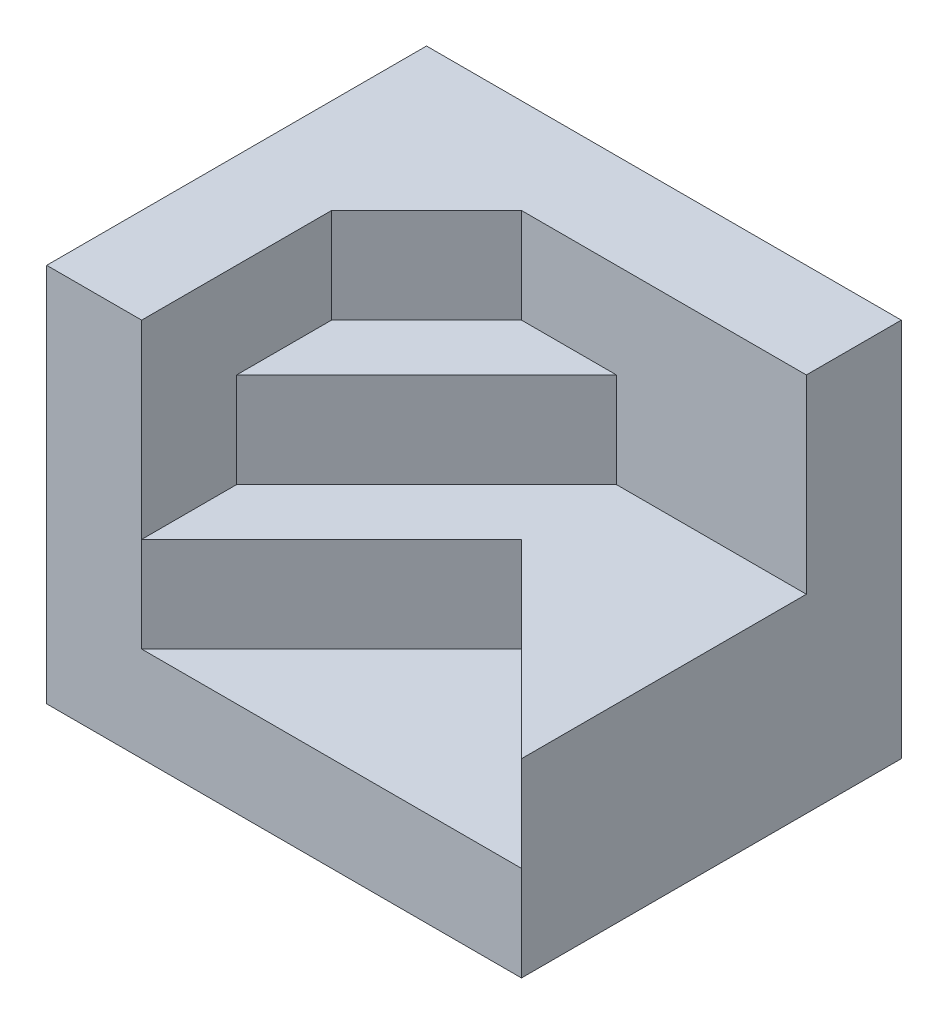
ISO-10303-21;
HEADER;
FILE_DESCRIPTION(('STEP AP214'),'2;1');
FILE_NAME('part.step','',(''),(''),'','','');
FILE_SCHEMA(('AUTOMOTIVE_DESIGN { 1 0 10303 214 1 1 1 1 }'));
ENDSEC;
DATA;
#1=APPLICATION_CONTEXT('core data for automotive mechanical design processes');
#2=APPLICATION_PROTOCOL_DEFINITION('international standard','automotive_design',2000,#1);
#3=PRODUCT_CONTEXT('',#1,'mechanical');
#4=PRODUCT('Part','Part','',(#3));
#5=PRODUCT_RELATED_PRODUCT_CATEGORY('part','',(#4));
#6=PRODUCT_DEFINITION_FORMATION('','',#4);
#7=PRODUCT_DEFINITION_CONTEXT('part definition',#1,'design');
#8=PRODUCT_DEFINITION('design','',#6,#7);
#9=PRODUCT_DEFINITION_SHAPE('','',#8);
#10=(LENGTH_UNIT() NAMED_UNIT(*) SI_UNIT(.MILLI.,.METRE.));
#11=(NAMED_UNIT(*) PLANE_ANGLE_UNIT() SI_UNIT($,.RADIAN.));
#12=(NAMED_UNIT(*) SI_UNIT($,.STERADIAN.) SOLID_ANGLE_UNIT());
#13=UNCERTAINTY_MEASURE_WITH_UNIT(LENGTH_MEASURE(1.E-05),#10,'distance_accuracy_value','');
#14=(GEOMETRIC_REPRESENTATION_CONTEXT(3) GLOBAL_UNCERTAINTY_ASSIGNED_CONTEXT((#13)) GLOBAL_UNIT_ASSIGNED_CONTEXT((#10,
#11,#12)) REPRESENTATION_CONTEXT('',''));
#15=CARTESIAN_POINT('',(0.,0.,0.));
#16=DIRECTION('',(0.,0.,1.));
#17=DIRECTION('',(1.,0.,0.));
#18=AXIS2_PLACEMENT_3D('',#15,#16,#17);
#19=CARTESIAN_POINT('',(-7.5,20.,0.));
#20=DIRECTION('',(-1.,0.,0.));
#21=DIRECTION('',(0.,0.,1.));
#22=AXIS2_PLACEMENT_3D('',#19,#20,#21);
#23=PLANE('',#22);
#24=DIRECTION('',(0.,-1.,0.));
#25=VECTOR('',#24,1.);
#26=CARTESIAN_POINT('',(-7.5,20.,10.));
#27=LINE('',#26,#25);
#28=CARTESIAN_POINT('',(-7.5,20.,10.));
#29=VERTEX_POINT('',#28);
#30=CARTESIAN_POINT('',(-7.5,10.,10.));
#31=VERTEX_POINT('',#30);
#32=EDGE_CURVE('E203',#29,#31,#27,.T.);
#33=ORIENTED_EDGE('',*,*,#32,.T.);
#34=DIRECTION('',(0.,0.,-1.));
#35=VECTOR('',#34,1.);
#36=CARTESIAN_POINT('',(-7.5,10.,0.));
#37=LINE('',#36,#35);
#38=CARTESIAN_POINT('',(-7.50000000000001,10.,5.));
#39=VERTEX_POINT('',#38);
#40=EDGE_CURVE('E167',#31,#39,#37,.T.);
#41=ORIENTED_EDGE('',*,*,#40,.T.);
#42=DIRECTION('',(0.,-1.,0.));
#43=VECTOR('',#42,1.);
#44=CARTESIAN_POINT('',(-7.50000000000001,15.,5.));
#45=LINE('',#44,#43);
#46=CARTESIAN_POINT('',(-7.5,15.,5.));
#47=VERTEX_POINT('',#46);
#48=EDGE_CURVE('E183',#47,#39,#45,.T.);
#49=ORIENTED_EDGE('',*,*,#48,.F.);
#50=DIRECTION('',(0.,0.,-1.));
#51=VECTOR('',#50,1.);
#52=CARTESIAN_POINT('',(-7.5,15.,0.));
#53=LINE('',#52,#51);
#54=CARTESIAN_POINT('',(-7.50000000000001,15.,0.));
#55=VERTEX_POINT('',#54);
#56=EDGE_CURVE('E181',#47,#55,#53,.T.);
#57=ORIENTED_EDGE('',*,*,#56,.T.);
#58=DIRECTION('',(0.,-1.,0.));
#59=VECTOR('',#58,1.);
#60=CARTESIAN_POINT('',(-7.50000000000001,20.,0.));
#61=LINE('',#60,#59);
#62=CARTESIAN_POINT('',(-7.50000000000001,20.,0.));
#63=VERTEX_POINT('',#62);
#64=EDGE_CURVE('E11',#63,#55,#61,.T.);
#65=ORIENTED_EDGE('',*,*,#64,.F.);
#66=DIRECTION('',(0.,0.,-1.));
#67=VECTOR('',#66,1.);
#68=CARTESIAN_POINT('',(-7.5,20.,0.));
#69=LINE('',#68,#67);
#70=EDGE_CURVE('E131',#29,#63,#69,.T.);
#71=ORIENTED_EDGE('',*,*,#70,.F.);
#72=EDGE_LOOP('',(#33,#41,#49,#57,#65,#71));
#73=FACE_BOUND('',#72,.T.);
#74=ADVANCED_FACE('F33',(#73),#23,.F.);
#75=CARTESIAN_POINT('',(-3.75,20.,-3.75));
#76=DIRECTION('',(-0.707106781186548,0.,-0.707106781186548));
#77=DIRECTION('',(-0.707106781186548,0.,0.707106781186548));
#78=AXIS2_PLACEMENT_3D('',#75,#76,#77);
#79=PLANE('',#78);
#80=ORIENTED_EDGE('',*,*,#64,.T.);
#81=DIRECTION('',(0.707106781186548,0.,-0.707106781186548));
#82=VECTOR('',#81,1.);
#83=CARTESIAN_POINT('',(-3.75,15.,-3.75));
#84=LINE('',#83,#82);
#85=CARTESIAN_POINT('',(-2.5,15.,-5.));
#86=VERTEX_POINT('',#85);
#87=EDGE_CURVE('E179',#55,#86,#84,.T.);
#88=ORIENTED_EDGE('',*,*,#87,.T.);
#89=DIRECTION('',(0.,-1.,0.));
#90=VECTOR('',#89,1.);
#91=CARTESIAN_POINT('',(-2.5,20.,-5.));
#92=LINE('',#91,#90);
#93=CARTESIAN_POINT('',(-2.5,20.,-5.));
#94=VERTEX_POINT('',#93);
#95=EDGE_CURVE('E40',#94,#86,#92,.T.);
#96=ORIENTED_EDGE('',*,*,#95,.F.);
#97=DIRECTION('',(0.707106781186548,0.,-0.707106781186548));
#98=VECTOR('',#97,1.);
#99=CARTESIAN_POINT('',(-3.75,20.,-3.75));
#100=LINE('',#99,#98);
#101=EDGE_CURVE('E190',#63,#94,#100,.T.);
#102=ORIENTED_EDGE('',*,*,#101,.F.);
#103=EDGE_LOOP('',(#80,#88,#96,#102));
#104=FACE_BOUND('',#103,.T.);
#105=ADVANCED_FACE('F241',(#104),#79,.F.);
#106=CARTESIAN_POINT('',(0.,20.,-5.));
#107=DIRECTION('',(0.,0.,-1.));
#108=DIRECTION('',(-1.,0.,0.));
#109=AXIS2_PLACEMENT_3D('',#106,#107,#108);
#110=PLANE('',#109);
#111=DIRECTION('',(0.,-1.,0.));
#112=VECTOR('',#111,1.);
#113=CARTESIAN_POINT('',(2.5,15.,-5.));
#114=LINE('',#113,#112);
#115=CARTESIAN_POINT('',(2.5,15.,-5.));
#116=VERTEX_POINT('',#115);
#117=CARTESIAN_POINT('',(2.5,10.,-5.));
#118=VERTEX_POINT('',#117);
#119=EDGE_CURVE('E142',#116,#118,#114,.T.);
#120=ORIENTED_EDGE('',*,*,#119,.T.);
#121=DIRECTION('',(1.,0.,0.));
#122=VECTOR('',#121,1.);
#123=CARTESIAN_POINT('',(0.,10.,-5.));
#124=LINE('',#123,#122);
#125=CARTESIAN_POINT('',(12.5,10.,-5.));
#126=VERTEX_POINT('',#125);
#127=EDGE_CURVE('E162',#118,#126,#124,.T.);
#128=ORIENTED_EDGE('',*,*,#127,.T.);
#129=DIRECTION('',(0.,-1.,0.));
#130=VECTOR('',#129,1.);
#131=CARTESIAN_POINT('',(12.5,20.,-5.));
#132=LINE('',#131,#130);
#133=CARTESIAN_POINT('',(12.5,20.,-5.));
#134=VERTEX_POINT('',#133);
#135=EDGE_CURVE('E214',#134,#126,#132,.T.);
#136=ORIENTED_EDGE('',*,*,#135,.F.);
#137=DIRECTION('',(1.,0.,0.));
#138=VECTOR('',#137,1.);
#139=CARTESIAN_POINT('',(0.,20.,-5.));
#140=LINE('',#139,#138);
#141=EDGE_CURVE('E192',#94,#134,#140,.T.);
#142=ORIENTED_EDGE('',*,*,#141,.F.);
#143=ORIENTED_EDGE('',*,*,#95,.T.);
#144=DIRECTION('',(1.,0.,0.));
#145=VECTOR('',#144,1.);
#146=CARTESIAN_POINT('',(0.,15.,-5.));
#147=LINE('',#146,#145);
#148=EDGE_CURVE('E177',#86,#116,#147,.T.);
#149=ORIENTED_EDGE('',*,*,#148,.T.);
#150=EDGE_LOOP('',(#120,#128,#136,#142,#143,#149));
#151=FACE_BOUND('',#150,.T.);
#152=ADVANCED_FACE('F221',(#151),#110,.F.);
#153=CARTESIAN_POINT('',(12.5,20.,0.));
#154=DIRECTION('',(-1.,0.,0.));
#155=DIRECTION('',(0.,0.,1.));
#156=AXIS2_PLACEMENT_3D('',#153,#154,#155);
#157=PLANE('',#156);
#158=DIRECTION('',(0.,0.,-1.));
#159=VECTOR('',#158,1.);
#160=CARTESIAN_POINT('',(12.5,0.,0.));
#161=LINE('',#160,#159);
#162=CARTESIAN_POINT('',(12.5,0.,10.));
#163=VERTEX_POINT('',#162);
#164=CARTESIAN_POINT('',(12.5,0.,-10.));
#165=VERTEX_POINT('',#164);
#166=EDGE_CURVE('E136',#163,#165,#161,.T.);
#167=ORIENTED_EDGE('',*,*,#166,.T.);
#168=DIRECTION('',(0.,-1.,0.));
#169=VECTOR('',#168,1.);
#170=CARTESIAN_POINT('',(12.5,20.,-10.));
#171=LINE('',#170,#169);
#172=CARTESIAN_POINT('',(12.5,20.,-10.));
#173=VERTEX_POINT('',#172);
#174=EDGE_CURVE('E212',#173,#165,#171,.T.);
#175=ORIENTED_EDGE('',*,*,#174,.F.);
#176=DIRECTION('',(0.,0.,-1.));
#177=VECTOR('',#176,1.);
#178=CARTESIAN_POINT('',(12.5,20.,0.));
#179=LINE('',#178,#177);
#180=EDGE_CURVE('E194',#134,#173,#179,.T.);
#181=ORIENTED_EDGE('',*,*,#180,.F.);
#182=ORIENTED_EDGE('',*,*,#135,.T.);
#183=DIRECTION('',(0.,0.,-1.));
#184=VECTOR('',#183,1.);
#185=CARTESIAN_POINT('',(12.5,10.,0.));
#186=LINE('',#185,#184);
#187=CARTESIAN_POINT('',(12.5,10.,10.));
#188=VERTEX_POINT('',#187);
#189=EDGE_CURVE('E160',#188,#126,#186,.T.);
#190=ORIENTED_EDGE('',*,*,#189,.F.);
#191=DIRECTION('',(0.,-1.,0.));
#192=VECTOR('',#191,1.);
#193=CARTESIAN_POINT('',(12.5,10.,10.));
#194=LINE('',#193,#192);
#195=CARTESIAN_POINT('',(12.5,5.,10.));
#196=VERTEX_POINT('',#195);
#197=EDGE_CURVE('E148',#188,#196,#194,.T.);
#198=ORIENTED_EDGE('',*,*,#197,.T.);
#199=DIRECTION('',(0.,-1.,0.));
#200=VECTOR('',#199,1.);
#201=CARTESIAN_POINT('',(12.5,5.,10.));
#202=LINE('',#201,#200);
#203=EDGE_CURVE('E125',#196,#163,#202,.T.);
#204=ORIENTED_EDGE('',*,*,#203,.T.);
#205=EDGE_LOOP('',(#167,#175,#181,#182,#190,#198,#204));
#206=FACE_BOUND('',#205,.T.);
#207=ADVANCED_FACE('F145',(#206),#157,.F.);
#208=CARTESIAN_POINT('',(0.,20.,-10.));
#209=DIRECTION('',(0.,0.,-1.));
#210=DIRECTION('',(-1.,0.,0.));
#211=AXIS2_PLACEMENT_3D('',#208,#209,#210);
#212=PLANE('',#211);
#213=DIRECTION('',(1.,0.,0.));
#214=VECTOR('',#213,1.);
#215=CARTESIAN_POINT('',(0.,0.,-10.));
#216=LINE('',#215,#214);
#217=CARTESIAN_POINT('',(-12.5,0.,-10.));
#218=VERTEX_POINT('',#217);
#219=EDGE_CURVE('E139',#218,#165,#216,.T.);
#220=ORIENTED_EDGE('',*,*,#219,.F.);
#221=DIRECTION('',(0.,-1.,0.));
#222=VECTOR('',#221,1.);
#223=CARTESIAN_POINT('',(-12.5,20.,-10.));
#224=LINE('',#223,#222);
#225=CARTESIAN_POINT('',(-12.5,20.,-10.));
#226=VERTEX_POINT('',#225);
#227=EDGE_CURVE('E210',#226,#218,#224,.T.);
#228=ORIENTED_EDGE('',*,*,#227,.F.);
#229=DIRECTION('',(1.,0.,0.));
#230=VECTOR('',#229,1.);
#231=CARTESIAN_POINT('',(0.,20.,-10.));
#232=LINE('',#231,#230);
#233=EDGE_CURVE('E196',#226,#173,#232,.T.);
#234=ORIENTED_EDGE('',*,*,#233,.T.);
#235=ORIENTED_EDGE('',*,*,#174,.T.);
#236=EDGE_LOOP('',(#220,#228,#234,#235));
#237=FACE_BOUND('',#236,.T.);
#238=ADVANCED_FACE('F273',(#237),#212,.T.);
#239=CARTESIAN_POINT('',(-12.5,20.,0.));
#240=DIRECTION('',(-1.,0.,0.));
#241=DIRECTION('',(0.,0.,1.));
#242=AXIS2_PLACEMENT_3D('',#239,#240,#241);
#243=PLANE('',#242);
#244=DIRECTION('',(0.,0.,-1.));
#245=VECTOR('',#244,1.);
#246=CARTESIAN_POINT('',(-12.5,0.,0.));
#247=LINE('',#246,#245);
#248=CARTESIAN_POINT('',(-12.5,0.,10.));
#249=VERTEX_POINT('',#248);
#250=EDGE_CURVE('E132',#249,#218,#247,.T.);
#251=ORIENTED_EDGE('',*,*,#250,.F.);
#252=DIRECTION('',(0.,-1.,0.));
#253=VECTOR('',#252,1.);
#254=CARTESIAN_POINT('',(-12.5,20.,10.));
#255=LINE('',#254,#253);
#256=CARTESIAN_POINT('',(-12.5,20.,10.));
#257=VERTEX_POINT('',#256);
#258=EDGE_CURVE('E127',#257,#249,#255,.T.);
#259=ORIENTED_EDGE('',*,*,#258,.F.);
#260=DIRECTION('',(0.,0.,-1.));
#261=VECTOR('',#260,1.);
#262=CARTESIAN_POINT('',(-12.5,20.,0.));
#263=LINE('',#262,#261);
#264=EDGE_CURVE('E199',#257,#226,#263,.T.);
#265=ORIENTED_EDGE('',*,*,#264,.T.);
#266=ORIENTED_EDGE('',*,*,#227,.T.);
#267=EDGE_LOOP('',(#251,#259,#265,#266));
#268=FACE_BOUND('',#267,.T.);
#269=ADVANCED_FACE('F276',(#268),#243,.T.);
#270=CARTESIAN_POINT('',(0.,20.,10.));
#271=DIRECTION('',(0.,0.,-1.));
#272=DIRECTION('',(-1.,0.,0.));
#273=AXIS2_PLACEMENT_3D('',#270,#271,#272);
#274=PLANE('',#273);
#275=DIRECTION('',(1.,0.,0.));
#276=VECTOR('',#275,1.);
#277=CARTESIAN_POINT('',(0.,0.,10.));
#278=LINE('',#277,#276);
#279=EDGE_CURVE('E121',#249,#163,#278,.T.);
#280=ORIENTED_EDGE('',*,*,#279,.T.);
#281=ORIENTED_EDGE('',*,*,#203,.F.);
#282=DIRECTION('',(1.,0.,0.));
#283=VECTOR('',#282,1.);
#284=CARTESIAN_POINT('',(0.,5.,10.));
#285=LINE('',#284,#283);
#286=CARTESIAN_POINT('',(-7.5,5.,10.));
#287=VERTEX_POINT('',#286);
#288=EDGE_CURVE('E151',#287,#196,#285,.T.);
#289=ORIENTED_EDGE('',*,*,#288,.F.);
#290=DIRECTION('',(0.,-1.,0.));
#291=VECTOR('',#290,1.);
#292=CARTESIAN_POINT('',(-7.5,10.,10.));
#293=LINE('',#292,#291);
#294=EDGE_CURVE('E47',#31,#287,#293,.T.);
#295=ORIENTED_EDGE('',*,*,#294,.F.);
#296=ORIENTED_EDGE('',*,*,#32,.F.);
#297=DIRECTION('',(1.,0.,0.));
#298=VECTOR('',#297,1.);
#299=CARTESIAN_POINT('',(0.,20.,10.));
#300=LINE('',#299,#298);
#301=EDGE_CURVE('E202',#257,#29,#300,.T.);
#302=ORIENTED_EDGE('',*,*,#301,.F.);
#303=ORIENTED_EDGE('',*,*,#258,.T.);
#304=EDGE_LOOP('',(#280,#281,#289,#295,#296,#302,#303));
#305=FACE_BOUND('',#304,.T.);
#306=ADVANCED_FACE('F123',(#305),#274,.F.);
#307=CARTESIAN_POINT('',(0.,20.,0.));
#308=DIRECTION('',(0.,1.,0.));
#309=DIRECTION('',(0.,0.,1.));
#310=AXIS2_PLACEMENT_3D('',#307,#308,#309);
#311=PLANE('',#310);
#312=ORIENTED_EDGE('',*,*,#70,.T.);
#313=ORIENTED_EDGE('',*,*,#101,.T.);
#314=ORIENTED_EDGE('',*,*,#141,.T.);
#315=ORIENTED_EDGE('',*,*,#180,.T.);
#316=ORIENTED_EDGE('',*,*,#233,.F.);
#317=ORIENTED_EDGE('',*,*,#264,.F.);
#318=ORIENTED_EDGE('',*,*,#301,.T.);
#319=EDGE_LOOP('',(#312,#313,#314,#315,#316,#317,#318));
#320=FACE_BOUND('',#319,.T.);
#321=ADVANCED_FACE('F237',(#320),#311,.T.);
#322=CARTESIAN_POINT('',(0.,0.,0.));
#323=DIRECTION('',(0.,1.,0.));
#324=DIRECTION('',(0.,0.,1.));
#325=AXIS2_PLACEMENT_3D('',#322,#323,#324);
#326=PLANE('',#325);
#327=ORIENTED_EDGE('',*,*,#166,.F.);
#328=ORIENTED_EDGE('',*,*,#279,.F.);
#329=ORIENTED_EDGE('',*,*,#250,.T.);
#330=ORIENTED_EDGE('',*,*,#219,.T.);
#331=EDGE_LOOP('',(#327,#328,#329,#330));
#332=FACE_BOUND('',#331,.T.);
#333=ADVANCED_FACE('F137',(#332),#326,.F.);
#334=CARTESIAN_POINT('',(-1.25,15.,-1.25));
#335=DIRECTION('',(0.707106781186547,0.,0.707106781186547));
#336=DIRECTION('',(0.707106781186548,0.,-0.707106781186548));
#337=AXIS2_PLACEMENT_3D('',#334,#335,#336);
#338=PLANE('',#337);
#339=DIRECTION('',(-0.707106781186548,0.,0.707106781186548));
#340=VECTOR('',#339,1.);
#341=CARTESIAN_POINT('',(-1.25,10.,-1.25));
#342=LINE('',#341,#340);
#343=EDGE_CURVE('E165',#118,#39,#342,.T.);
#344=ORIENTED_EDGE('',*,*,#343,.F.);
#345=ORIENTED_EDGE('',*,*,#119,.F.);
#346=DIRECTION('',(-0.707106781186548,0.,0.707106781186548));
#347=VECTOR('',#346,1.);
#348=CARTESIAN_POINT('',(-1.25,15.,-1.25));
#349=LINE('',#348,#347);
#350=EDGE_CURVE('E174',#116,#47,#349,.T.);
#351=ORIENTED_EDGE('',*,*,#350,.T.);
#352=ORIENTED_EDGE('',*,*,#48,.T.);
#353=EDGE_LOOP('',(#344,#345,#351,#352));
#354=FACE_BOUND('',#353,.T.);
#355=ADVANCED_FACE('F232',(#354),#338,.T.);
#356=CARTESIAN_POINT('',(0.,15.,0.));
#357=DIRECTION('',(0.,1.,0.));
#358=DIRECTION('',(0.,0.,1.));
#359=AXIS2_PLACEMENT_3D('',#356,#357,#358);
#360=PLANE('',#359);
#361=ORIENTED_EDGE('',*,*,#350,.F.);
#362=ORIENTED_EDGE('',*,*,#148,.F.);
#363=ORIENTED_EDGE('',*,*,#87,.F.);
#364=ORIENTED_EDGE('',*,*,#56,.F.);
#365=EDGE_LOOP('',(#361,#362,#363,#364));
#366=FACE_BOUND('',#365,.T.);
#367=ADVANCED_FACE('F228',(#366),#360,.T.);
#368=CARTESIAN_POINT('',(1.25,10.,1.25));
#369=DIRECTION('',(-0.707106781186548,0.,-0.707106781186548));
#370=DIRECTION('',(-0.707106781186548,0.,0.707106781186548));
#371=AXIS2_PLACEMENT_3D('',#368,#369,#370);
#372=PLANE('',#371);
#373=ORIENTED_EDGE('',*,*,#294,.T.);
#374=DIRECTION('',(0.707106781186548,0.,-0.707106781186548));
#375=VECTOR('',#374,1.);
#376=CARTESIAN_POINT('',(1.25,5.,1.25));
#377=LINE('',#376,#375);
#378=CARTESIAN_POINT('',(2.5,5.,0.));
#379=VERTEX_POINT('',#378);
#380=EDGE_CURVE('E52',#287,#379,#377,.T.);
#381=ORIENTED_EDGE('',*,*,#380,.T.);
#382=DIRECTION('',(0.,-1.,0.));
#383=VECTOR('',#382,1.);
#384=CARTESIAN_POINT('',(2.5,10.,0.));
#385=LINE('',#384,#383);
#386=CARTESIAN_POINT('',(2.5,10.,0.));
#387=VERTEX_POINT('',#386);
#388=EDGE_CURVE('E172',#387,#379,#385,.T.);
#389=ORIENTED_EDGE('',*,*,#388,.F.);
#390=DIRECTION('',(0.707106781186548,0.,-0.707106781186548));
#391=VECTOR('',#390,1.);
#392=CARTESIAN_POINT('',(1.25,10.,1.25));
#393=LINE('',#392,#391);
#394=EDGE_CURVE('E150',#31,#387,#393,.T.);
#395=ORIENTED_EDGE('',*,*,#394,.F.);
#396=EDGE_LOOP('',(#373,#381,#389,#395));
#397=FACE_BOUND('',#396,.T.);
#398=ADVANCED_FACE('F253',(#397),#372,.F.);
#399=CARTESIAN_POINT('',(1.25,10.,-1.25));
#400=DIRECTION('',(0.707106781186548,0.,-0.707106781186548));
#401=DIRECTION('',(-0.707106781186548,0.,-0.707106781186548));
#402=AXIS2_PLACEMENT_3D('',#399,#400,#401);
#403=PLANE('',#402);
#404=ORIENTED_EDGE('',*,*,#388,.T.);
#405=DIRECTION('',(0.707106781186548,0.,0.707106781186548));
#406=VECTOR('',#405,1.);
#407=CARTESIAN_POINT('',(1.25,5.,-1.25));
#408=LINE('',#407,#406);
#409=EDGE_CURVE('E249',#379,#196,#408,.T.);
#410=ORIENTED_EDGE('',*,*,#409,.T.);
#411=ORIENTED_EDGE('',*,*,#197,.F.);
#412=DIRECTION('',(0.707106781186548,0.,0.707106781186548));
#413=VECTOR('',#412,1.);
#414=CARTESIAN_POINT('',(1.25,10.,-1.25));
#415=LINE('',#414,#413);
#416=EDGE_CURVE('E154',#387,#188,#415,.T.);
#417=ORIENTED_EDGE('',*,*,#416,.F.);
#418=EDGE_LOOP('',(#404,#410,#411,#417));
#419=FACE_BOUND('',#418,.T.);
#420=ADVANCED_FACE('F252',(#419),#403,.F.);
#421=CARTESIAN_POINT('',(0.,10.,0.));
#422=DIRECTION('',(0.,1.,0.));
#423=DIRECTION('',(0.,0.,1.));
#424=AXIS2_PLACEMENT_3D('',#421,#422,#423);
#425=PLANE('',#424);
#426=ORIENTED_EDGE('',*,*,#394,.T.);
#427=ORIENTED_EDGE('',*,*,#416,.T.);
#428=ORIENTED_EDGE('',*,*,#189,.T.);
#429=ORIENTED_EDGE('',*,*,#127,.F.);
#430=ORIENTED_EDGE('',*,*,#343,.T.);
#431=ORIENTED_EDGE('',*,*,#40,.F.);
#432=EDGE_LOOP('',(#426,#427,#428,#429,#430,#431));
#433=FACE_BOUND('',#432,.T.);
#434=ADVANCED_FACE('F245',(#433),#425,.T.);
#435=CARTESIAN_POINT('',(0.,5.,0.));
#436=DIRECTION('',(0.,1.,0.));
#437=DIRECTION('',(0.,0.,1.));
#438=AXIS2_PLACEMENT_3D('',#435,#436,#437);
#439=PLANE('',#438);
#440=ORIENTED_EDGE('',*,*,#409,.F.);
#441=ORIENTED_EDGE('',*,*,#380,.F.);
#442=ORIENTED_EDGE('',*,*,#288,.T.);
#443=EDGE_LOOP('',(#440,#441,#442));
#444=FACE_BOUND('',#443,.T.);
#445=ADVANCED_FACE('F248',(#444),#439,.T.);
#446=CLOSED_SHELL('',(#74,#105,#152,#207,#238,#269,#306,#321,#333,#355,#367,#398,#420,#434,#445));
#447=MANIFOLD_SOLID_BREP('B2',#446);
#448=ADVANCED_BREP_SHAPE_REPRESENTATION('',(#18,#447),#14);
#449=SHAPE_DEFINITION_REPRESENTATION(#9,#448);
ENDSEC;
END-ISO-10303-21;
